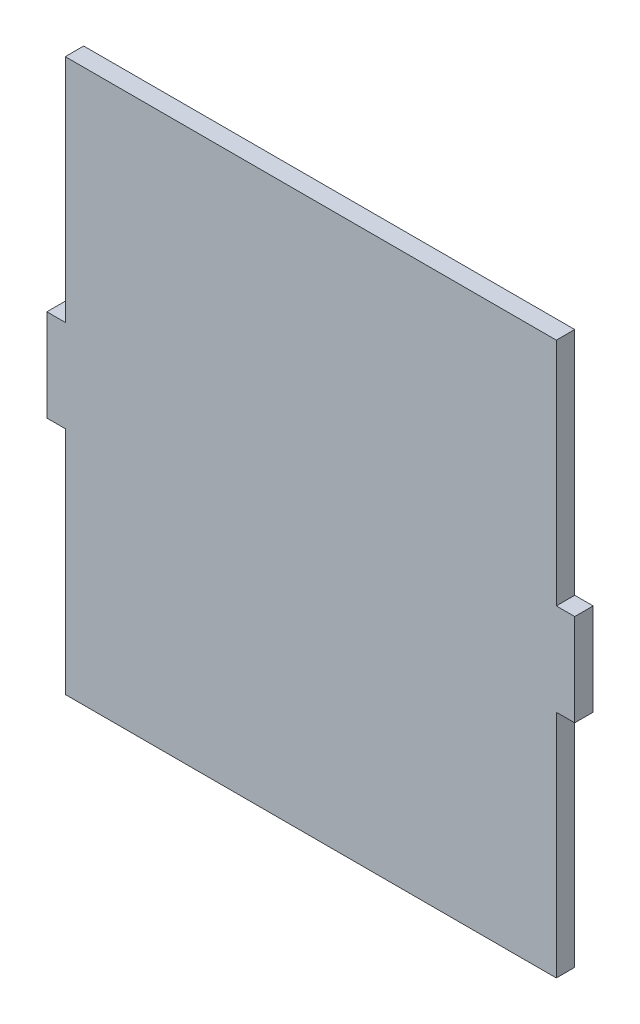
ISO-10303-21;
HEADER;
FILE_DESCRIPTION(('STEP AP214'),'2;1');
FILE_NAME('part.step','',(''),(''),'','','');
FILE_SCHEMA(('AUTOMOTIVE_DESIGN { 1 0 10303 214 1 1 1 1 }'));
ENDSEC;
DATA;
#1=APPLICATION_CONTEXT('core data for automotive mechanical design processes');
#2=APPLICATION_PROTOCOL_DEFINITION('international standard','automotive_design',2000,#1);
#3=PRODUCT_CONTEXT('',#1,'mechanical');
#4=PRODUCT('Part','Part','',(#3));
#5=PRODUCT_RELATED_PRODUCT_CATEGORY('part','',(#4));
#6=PRODUCT_DEFINITION_FORMATION('','',#4);
#7=PRODUCT_DEFINITION_CONTEXT('part definition',#1,'design');
#8=PRODUCT_DEFINITION('design','',#6,#7);
#9=PRODUCT_DEFINITION_SHAPE('','',#8);
#10=(LENGTH_UNIT() NAMED_UNIT(*) SI_UNIT(.MILLI.,.METRE.));
#11=(NAMED_UNIT(*) PLANE_ANGLE_UNIT() SI_UNIT($,.RADIAN.));
#12=(NAMED_UNIT(*) SI_UNIT($,.STERADIAN.) SOLID_ANGLE_UNIT());
#13=UNCERTAINTY_MEASURE_WITH_UNIT(LENGTH_MEASURE(1.E-05),#10,'distance_accuracy_value','');
#14=(GEOMETRIC_REPRESENTATION_CONTEXT(3) GLOBAL_UNCERTAINTY_ASSIGNED_CONTEXT((#13)) GLOBAL_UNIT_ASSIGNED_CONTEXT((#10,
#11,#12)) REPRESENTATION_CONTEXT('',''));
#15=CARTESIAN_POINT('',(0.,0.,0.));
#16=DIRECTION('',(0.,0.,1.));
#17=DIRECTION('',(1.,0.,0.));
#18=AXIS2_PLACEMENT_3D('',#15,#16,#17);
#19=CARTESIAN_POINT('',(0.,7.49999999999999,3.));
#20=DIRECTION('',(0.,-1.,0.));
#21=DIRECTION('',(0.,0.,-1.));
#22=AXIS2_PLACEMENT_3D('',#19,#20,#21);
#23=PLANE('',#22);
#24=DIRECTION('',(-1.,0.,0.));
#25=VECTOR('',#24,1.);
#26=CARTESIAN_POINT('',(0.,7.49999999999999,0.));
#27=LINE('',#26,#25);
#28=CARTESIAN_POINT('',(-40.,7.49999999999999,0.));
#29=VERTEX_POINT('',#28);
#30=CARTESIAN_POINT('',(-43.,7.49999999999999,0.));
#31=VERTEX_POINT('',#30);
#32=EDGE_CURVE('E157',#29,#31,#27,.T.);
#33=ORIENTED_EDGE('',*,*,#32,.T.);
#34=DIRECTION('',(0.,0.,-1.));
#35=VECTOR('',#34,1.);
#36=CARTESIAN_POINT('',(-43.,7.49999999999999,3.));
#37=LINE('',#36,#35);
#38=CARTESIAN_POINT('',(-43.,7.49999999999999,3.));
#39=VERTEX_POINT('',#38);
#40=EDGE_CURVE('E11',#39,#31,#37,.T.);
#41=ORIENTED_EDGE('',*,*,#40,.F.);
#42=DIRECTION('',(-1.,0.,0.));
#43=VECTOR('',#42,1.);
#44=CARTESIAN_POINT('',(0.,7.49999999999999,3.));
#45=LINE('',#44,#43);
#46=CARTESIAN_POINT('',(-40.,7.49999999999999,3.));
#47=VERTEX_POINT('',#46);
#48=EDGE_CURVE('E235',#47,#39,#45,.T.);
#49=ORIENTED_EDGE('',*,*,#48,.F.);
#50=DIRECTION('',(0.,0.,-1.));
#51=VECTOR('',#50,1.);
#52=CARTESIAN_POINT('',(-40.,7.49999999999999,3.));
#53=LINE('',#52,#51);
#54=EDGE_CURVE('E151',#47,#29,#53,.T.);
#55=ORIENTED_EDGE('',*,*,#54,.T.);
#56=EDGE_LOOP('',(#33,#41,#49,#55));
#57=FACE_BOUND('',#56,.T.);
#58=ADVANCED_FACE('F35',(#57),#23,.F.);
#59=CARTESIAN_POINT('',(-43.,0.,3.));
#60=DIRECTION('',(1.,0.,0.));
#61=DIRECTION('',(0.,0.,-1.));
#62=AXIS2_PLACEMENT_3D('',#59,#60,#61);
#63=PLANE('',#62);
#64=DIRECTION('',(0.,-1.,0.));
#65=VECTOR('',#64,1.);
#66=CARTESIAN_POINT('',(-43.,0.,0.));
#67=LINE('',#66,#65);
#68=CARTESIAN_POINT('',(-43.,-7.50000000000001,0.));
#69=VERTEX_POINT('',#68);
#70=EDGE_CURVE('E160',#31,#69,#67,.T.);
#71=ORIENTED_EDGE('',*,*,#70,.T.);
#72=DIRECTION('',(0.,0.,-1.));
#73=VECTOR('',#72,1.);
#74=CARTESIAN_POINT('',(-43.,-7.50000000000001,3.));
#75=LINE('',#74,#73);
#76=CARTESIAN_POINT('',(-43.,-7.50000000000001,3.));
#77=VERTEX_POINT('',#76);
#78=EDGE_CURVE('E43',#77,#69,#75,.T.);
#79=ORIENTED_EDGE('',*,*,#78,.F.);
#80=DIRECTION('',(0.,-1.,0.));
#81=VECTOR('',#80,1.);
#82=CARTESIAN_POINT('',(-43.,0.,3.));
#83=LINE('',#82,#81);
#84=EDGE_CURVE('E102',#39,#77,#83,.T.);
#85=ORIENTED_EDGE('',*,*,#84,.F.);
#86=ORIENTED_EDGE('',*,*,#40,.T.);
#87=EDGE_LOOP('',(#71,#79,#85,#86));
#88=FACE_BOUND('',#87,.T.);
#89=ADVANCED_FACE('F206',(#88),#63,.F.);
#90=CARTESIAN_POINT('',(0.,-7.50000000000001,3.));
#91=DIRECTION('',(0.,-1.,0.));
#92=DIRECTION('',(0.,0.,-1.));
#93=AXIS2_PLACEMENT_3D('',#90,#91,#92);
#94=PLANE('',#93);
#95=DIRECTION('',(-1.,0.,0.));
#96=VECTOR('',#95,1.);
#97=CARTESIAN_POINT('',(0.,-7.50000000000001,0.));
#98=LINE('',#97,#96);
#99=CARTESIAN_POINT('',(-40.,-7.50000000000001,0.));
#100=VERTEX_POINT('',#99);
#101=EDGE_CURVE('E163',#100,#69,#98,.T.);
#102=ORIENTED_EDGE('',*,*,#101,.F.);
#103=DIRECTION('',(0.,0.,-1.));
#104=VECTOR('',#103,1.);
#105=CARTESIAN_POINT('',(-40.,-7.50000000000001,3.));
#106=LINE('',#105,#104);
#107=CARTESIAN_POINT('',(-40.,-7.50000000000001,3.));
#108=VERTEX_POINT('',#107);
#109=EDGE_CURVE('E199',#108,#100,#106,.T.);
#110=ORIENTED_EDGE('',*,*,#109,.F.);
#111=DIRECTION('',(-1.,0.,0.));
#112=VECTOR('',#111,1.);
#113=CARTESIAN_POINT('',(0.,-7.50000000000001,3.));
#114=LINE('',#113,#112);
#115=EDGE_CURVE('E205',#108,#77,#114,.T.);
#116=ORIENTED_EDGE('',*,*,#115,.T.);
#117=ORIENTED_EDGE('',*,*,#78,.T.);
#118=EDGE_LOOP('',(#102,#110,#116,#117));
#119=FACE_BOUND('',#118,.T.);
#120=ADVANCED_FACE('F203',(#119),#94,.T.);
#121=CARTESIAN_POINT('',(-40.,0.,3.));
#122=DIRECTION('',(1.,0.,0.));
#123=DIRECTION('',(0.,0.,-1.));
#124=AXIS2_PLACEMENT_3D('',#121,#122,#123);
#125=PLANE('',#124);
#126=DIRECTION('',(0.,-1.,0.));
#127=VECTOR('',#126,1.);
#128=CARTESIAN_POINT('',(-40.,0.,0.));
#129=LINE('',#128,#127);
#130=CARTESIAN_POINT('',(-40.,-45.,0.));
#131=VERTEX_POINT('',#130);
#132=EDGE_CURVE('E166',#100,#131,#129,.T.);
#133=ORIENTED_EDGE('',*,*,#132,.T.);
#134=DIRECTION('',(0.,0.,-1.));
#135=VECTOR('',#134,1.);
#136=CARTESIAN_POINT('',(-40.,-45.,3.));
#137=LINE('',#136,#135);
#138=CARTESIAN_POINT('',(-40.,-45.,3.));
#139=VERTEX_POINT('',#138);
#140=EDGE_CURVE('E196',#139,#131,#137,.T.);
#141=ORIENTED_EDGE('',*,*,#140,.F.);
#142=DIRECTION('',(0.,-1.,0.));
#143=VECTOR('',#142,1.);
#144=CARTESIAN_POINT('',(-40.,0.,3.));
#145=LINE('',#144,#143);
#146=EDGE_CURVE('E153',#108,#139,#145,.T.);
#147=ORIENTED_EDGE('',*,*,#146,.F.);
#148=ORIENTED_EDGE('',*,*,#109,.T.);
#149=EDGE_LOOP('',(#133,#141,#147,#148));
#150=FACE_BOUND('',#149,.T.);
#151=ADVANCED_FACE('F215',(#150),#125,.F.);
#152=CARTESIAN_POINT('',(0.,-45.,3.));
#153=DIRECTION('',(0.,1.,0.));
#154=DIRECTION('',(0.,0.,1.));
#155=AXIS2_PLACEMENT_3D('',#152,#153,#154);
#156=PLANE('',#155);
#157=DIRECTION('',(1.,0.,0.));
#158=VECTOR('',#157,1.);
#159=CARTESIAN_POINT('',(0.,-45.,0.));
#160=LINE('',#159,#158);
#161=CARTESIAN_POINT('',(40.,-45.,0.));
#162=VERTEX_POINT('',#161);
#163=EDGE_CURVE('E168',#131,#162,#160,.T.);
#164=ORIENTED_EDGE('',*,*,#163,.T.);
#165=DIRECTION('',(0.,0.,-1.));
#166=VECTOR('',#165,1.);
#167=CARTESIAN_POINT('',(40.,-45.,3.));
#168=LINE('',#167,#166);
#169=CARTESIAN_POINT('',(40.,-45.,3.));
#170=VERTEX_POINT('',#169);
#171=EDGE_CURVE('E194',#170,#162,#168,.T.);
#172=ORIENTED_EDGE('',*,*,#171,.F.);
#173=DIRECTION('',(1.,0.,0.));
#174=VECTOR('',#173,1.);
#175=CARTESIAN_POINT('',(0.,-45.,3.));
#176=LINE('',#175,#174);
#177=EDGE_CURVE('E221',#139,#170,#176,.T.);
#178=ORIENTED_EDGE('',*,*,#177,.F.);
#179=ORIENTED_EDGE('',*,*,#140,.T.);
#180=EDGE_LOOP('',(#164,#172,#178,#179));
#181=FACE_BOUND('',#180,.T.);
#182=ADVANCED_FACE('F219',(#181),#156,.F.);
#183=CARTESIAN_POINT('',(40.,0.,3.));
#184=DIRECTION('',(1.,0.,0.));
#185=DIRECTION('',(0.,0.,-1.));
#186=AXIS2_PLACEMENT_3D('',#183,#184,#185);
#187=PLANE('',#186);
#188=DIRECTION('',(0.,-1.,0.));
#189=VECTOR('',#188,1.);
#190=CARTESIAN_POINT('',(40.,0.,0.));
#191=LINE('',#190,#189);
#192=CARTESIAN_POINT('',(40.,-7.5,0.));
#193=VERTEX_POINT('',#192);
#194=EDGE_CURVE('E171',#193,#162,#191,.T.);
#195=ORIENTED_EDGE('',*,*,#194,.F.);
#196=DIRECTION('',(0.,0.,-1.));
#197=VECTOR('',#196,1.);
#198=CARTESIAN_POINT('',(40.,-7.5,3.));
#199=LINE('',#198,#197);
#200=CARTESIAN_POINT('',(40.,-7.5,3.));
#201=VERTEX_POINT('',#200);
#202=EDGE_CURVE('E192',#201,#193,#199,.T.);
#203=ORIENTED_EDGE('',*,*,#202,.F.);
#204=DIRECTION('',(0.,-1.,0.));
#205=VECTOR('',#204,1.);
#206=CARTESIAN_POINT('',(40.,0.,3.));
#207=LINE('',#206,#205);
#208=EDGE_CURVE('E148',#201,#170,#207,.T.);
#209=ORIENTED_EDGE('',*,*,#208,.T.);
#210=ORIENTED_EDGE('',*,*,#171,.T.);
#211=EDGE_LOOP('',(#195,#203,#209,#210));
#212=FACE_BOUND('',#211,.T.);
#213=ADVANCED_FACE('F262',(#212),#187,.T.);
#214=CARTESIAN_POINT('',(0.,-7.5000000000001,3.));
#215=DIRECTION('',(0.,1.,0.));
#216=DIRECTION('',(-1.,0.,0.));
#217=AXIS2_PLACEMENT_3D('',#214,#215,#216);
#218=PLANE('',#217);
#219=DIRECTION('',(1.,0.,0.));
#220=VECTOR('',#219,1.);
#221=CARTESIAN_POINT('',(0.,-7.5000000000001,0.));
#222=LINE('',#221,#220);
#223=CARTESIAN_POINT('',(43.,-7.5,0.));
#224=VERTEX_POINT('',#223);
#225=EDGE_CURVE('E174',#193,#224,#222,.T.);
#226=ORIENTED_EDGE('',*,*,#225,.T.);
#227=DIRECTION('',(0.,0.,-1.));
#228=VECTOR('',#227,1.);
#229=CARTESIAN_POINT('',(43.,-7.5,3.));
#230=LINE('',#229,#228);
#231=CARTESIAN_POINT('',(43.,-7.5,3.));
#232=VERTEX_POINT('',#231);
#233=EDGE_CURVE('E190',#232,#224,#230,.T.);
#234=ORIENTED_EDGE('',*,*,#233,.F.);
#235=DIRECTION('',(1.,0.,0.));
#236=VECTOR('',#235,1.);
#237=CARTESIAN_POINT('',(0.,-7.5000000000001,3.));
#238=LINE('',#237,#236);
#239=EDGE_CURVE('E225',#201,#232,#238,.T.);
#240=ORIENTED_EDGE('',*,*,#239,.F.);
#241=ORIENTED_EDGE('',*,*,#202,.T.);
#242=EDGE_LOOP('',(#226,#234,#240,#241));
#243=FACE_BOUND('',#242,.T.);
#244=ADVANCED_FACE('F263',(#243),#218,.F.);
#245=CARTESIAN_POINT('',(43.,0.,3.));
#246=DIRECTION('',(1.,0.,0.));
#247=DIRECTION('',(0.,0.,-1.));
#248=AXIS2_PLACEMENT_3D('',#245,#246,#247);
#249=PLANE('',#248);
#250=DIRECTION('',(0.,-1.,0.));
#251=VECTOR('',#250,1.);
#252=CARTESIAN_POINT('',(43.,0.,0.));
#253=LINE('',#252,#251);
#254=CARTESIAN_POINT('',(43.,7.5,0.));
#255=VERTEX_POINT('',#254);
#256=EDGE_CURVE('E177',#255,#224,#253,.T.);
#257=ORIENTED_EDGE('',*,*,#256,.F.);
#258=DIRECTION('',(0.,0.,-1.));
#259=VECTOR('',#258,1.);
#260=CARTESIAN_POINT('',(43.,7.5,3.));
#261=LINE('',#260,#259);
#262=CARTESIAN_POINT('',(43.,7.5,3.));
#263=VERTEX_POINT('',#262);
#264=EDGE_CURVE('E188',#263,#255,#261,.T.);
#265=ORIENTED_EDGE('',*,*,#264,.F.);
#266=DIRECTION('',(0.,-1.,0.));
#267=VECTOR('',#266,1.);
#268=CARTESIAN_POINT('',(43.,0.,3.));
#269=LINE('',#268,#267);
#270=EDGE_CURVE('E228',#263,#232,#269,.T.);
#271=ORIENTED_EDGE('',*,*,#270,.T.);
#272=ORIENTED_EDGE('',*,*,#233,.T.);
#273=EDGE_LOOP('',(#257,#265,#271,#272));
#274=FACE_BOUND('',#273,.T.);
#275=ADVANCED_FACE('F266',(#274),#249,.T.);
#276=CARTESIAN_POINT('',(0.,7.4999999999998,3.));
#277=DIRECTION('',(0.,1.,0.));
#278=DIRECTION('',(-1.,0.,0.));
#279=AXIS2_PLACEMENT_3D('',#276,#277,#278);
#280=PLANE('',#279);
#281=DIRECTION('',(1.,0.,0.));
#282=VECTOR('',#281,1.);
#283=CARTESIAN_POINT('',(0.,7.4999999999998,0.));
#284=LINE('',#283,#282);
#285=CARTESIAN_POINT('',(40.,7.49999999999999,0.));
#286=VERTEX_POINT('',#285);
#287=EDGE_CURVE('E180',#286,#255,#284,.T.);
#288=ORIENTED_EDGE('',*,*,#287,.F.);
#289=DIRECTION('',(0.,0.,-1.));
#290=VECTOR('',#289,1.);
#291=CARTESIAN_POINT('',(40.,7.49999999999999,3.));
#292=LINE('',#291,#290);
#293=CARTESIAN_POINT('',(40.,7.49999999999999,3.));
#294=VERTEX_POINT('',#293);
#295=EDGE_CURVE('E139',#294,#286,#292,.T.);
#296=ORIENTED_EDGE('',*,*,#295,.F.);
#297=DIRECTION('',(1.,0.,0.));
#298=VECTOR('',#297,1.);
#299=CARTESIAN_POINT('',(0.,7.4999999999998,3.));
#300=LINE('',#299,#298);
#301=EDGE_CURVE('E146',#294,#263,#300,.T.);
#302=ORIENTED_EDGE('',*,*,#301,.T.);
#303=ORIENTED_EDGE('',*,*,#264,.T.);
#304=EDGE_LOOP('',(#288,#296,#302,#303));
#305=FACE_BOUND('',#304,.T.);
#306=ADVANCED_FACE('F233',(#305),#280,.T.);
#307=CARTESIAN_POINT('',(40.,45.,0.));
#308=VERTEX_POINT('',#307);
#309=EDGE_CURVE('E134',#308,#286,#191,.T.);
#310=ORIENTED_EDGE('',*,*,#309,.F.);
#311=DIRECTION('',(0.,0.,-1.));
#312=VECTOR('',#311,1.);
#313=CARTESIAN_POINT('',(40.,45.,3.));
#314=LINE('',#313,#312);
#315=CARTESIAN_POINT('',(40.,45.,3.));
#316=VERTEX_POINT('',#315);
#317=EDGE_CURVE('E129',#316,#308,#314,.T.);
#318=ORIENTED_EDGE('',*,*,#317,.F.);
#319=EDGE_CURVE('E132',#316,#294,#207,.T.);
#320=ORIENTED_EDGE('',*,*,#319,.T.);
#321=ORIENTED_EDGE('',*,*,#295,.T.);
#322=EDGE_LOOP('',(#310,#318,#320,#321));
#323=FACE_BOUND('',#322,.T.);
#324=ADVANCED_FACE('F131',(#323),#187,.T.);
#325=CARTESIAN_POINT('',(0.,45.,3.));
#326=DIRECTION('',(0.,1.,0.));
#327=DIRECTION('',(0.,0.,1.));
#328=AXIS2_PLACEMENT_3D('',#325,#326,#327);
#329=PLANE('',#328);
#330=DIRECTION('',(1.,0.,0.));
#331=VECTOR('',#330,1.);
#332=CARTESIAN_POINT('',(0.,45.,0.));
#333=LINE('',#332,#331);
#334=CARTESIAN_POINT('',(-40.,45.,0.));
#335=VERTEX_POINT('',#334);
#336=EDGE_CURVE('E183',#335,#308,#333,.T.);
#337=ORIENTED_EDGE('',*,*,#336,.F.);
#338=DIRECTION('',(0.,0.,-1.));
#339=VECTOR('',#338,1.);
#340=CARTESIAN_POINT('',(-40.,45.,3.));
#341=LINE('',#340,#339);
#342=CARTESIAN_POINT('',(-40.,45.,3.));
#343=VERTEX_POINT('',#342);
#344=EDGE_CURVE('E91',#343,#335,#341,.T.);
#345=ORIENTED_EDGE('',*,*,#344,.F.);
#346=DIRECTION('',(1.,0.,0.));
#347=VECTOR('',#346,1.);
#348=CARTESIAN_POINT('',(0.,45.,3.));
#349=LINE('',#348,#347);
#350=EDGE_CURVE('E143',#343,#316,#349,.T.);
#351=ORIENTED_EDGE('',*,*,#350,.T.);
#352=ORIENTED_EDGE('',*,*,#317,.T.);
#353=EDGE_LOOP('',(#337,#345,#351,#352));
#354=FACE_BOUND('',#353,.T.);
#355=ADVANCED_FACE('F149',(#354),#329,.T.);
#356=EDGE_CURVE('E94',#335,#29,#129,.T.);
#357=ORIENTED_EDGE('',*,*,#356,.T.);
#358=ORIENTED_EDGE('',*,*,#54,.F.);
#359=EDGE_CURVE('E51',#343,#47,#145,.T.);
#360=ORIENTED_EDGE('',*,*,#359,.F.);
#361=ORIENTED_EDGE('',*,*,#344,.T.);
#362=EDGE_LOOP('',(#357,#358,#360,#361));
#363=FACE_BOUND('',#362,.T.);
#364=ADVANCED_FACE('F240',(#363),#125,.F.);
#365=CARTESIAN_POINT('',(0.,0.,3.));
#366=DIRECTION('',(0.,0.,1.));
#367=DIRECTION('',(1.,0.,0.));
#368=AXIS2_PLACEMENT_3D('',#365,#366,#367);
#369=PLANE('',#368);
#370=ORIENTED_EDGE('',*,*,#48,.T.);
#371=ORIENTED_EDGE('',*,*,#84,.T.);
#372=ORIENTED_EDGE('',*,*,#115,.F.);
#373=ORIENTED_EDGE('',*,*,#146,.T.);
#374=ORIENTED_EDGE('',*,*,#177,.T.);
#375=ORIENTED_EDGE('',*,*,#208,.F.);
#376=ORIENTED_EDGE('',*,*,#239,.T.);
#377=ORIENTED_EDGE('',*,*,#270,.F.);
#378=ORIENTED_EDGE('',*,*,#301,.F.);
#379=ORIENTED_EDGE('',*,*,#319,.F.);
#380=ORIENTED_EDGE('',*,*,#350,.F.);
#381=ORIENTED_EDGE('',*,*,#359,.T.);
#382=EDGE_LOOP('',(#370,#371,#372,#373,#374,#375,#376,#377,#378,#379,#380,#381));
#383=FACE_BOUND('',#382,.T.);
#384=ADVANCED_FACE('F142',(#383),#369,.T.);
#385=CARTESIAN_POINT('',(0.,0.,0.));
#386=DIRECTION('',(0.,0.,1.));
#387=DIRECTION('',(1.,0.,0.));
#388=AXIS2_PLACEMENT_3D('',#385,#386,#387);
#389=PLANE('',#388);
#390=ORIENTED_EDGE('',*,*,#32,.F.);
#391=ORIENTED_EDGE('',*,*,#356,.F.);
#392=ORIENTED_EDGE('',*,*,#336,.T.);
#393=ORIENTED_EDGE('',*,*,#309,.T.);
#394=ORIENTED_EDGE('',*,*,#287,.T.);
#395=ORIENTED_EDGE('',*,*,#256,.T.);
#396=ORIENTED_EDGE('',*,*,#225,.F.);
#397=ORIENTED_EDGE('',*,*,#194,.T.);
#398=ORIENTED_EDGE('',*,*,#163,.F.);
#399=ORIENTED_EDGE('',*,*,#132,.F.);
#400=ORIENTED_EDGE('',*,*,#101,.T.);
#401=ORIENTED_EDGE('',*,*,#70,.F.);
#402=EDGE_LOOP('',(#390,#391,#392,#393,#394,#395,#396,#397,#398,#399,#400,#401));
#403=FACE_BOUND('',#402,.T.);
#404=ADVANCED_FACE('F211',(#403),#389,.F.);
#405=CLOSED_SHELL('',(#58,#89,#120,#151,#182,#213,#244,#275,#306,#324,#355,#364,#384,#404));
#406=MANIFOLD_SOLID_BREP('B2',#405);
#407=ADVANCED_BREP_SHAPE_REPRESENTATION('',(#18,#406),#14);
#408=SHAPE_DEFINITION_REPRESENTATION(#9,#407);
ENDSEC;
END-ISO-10303-21;
